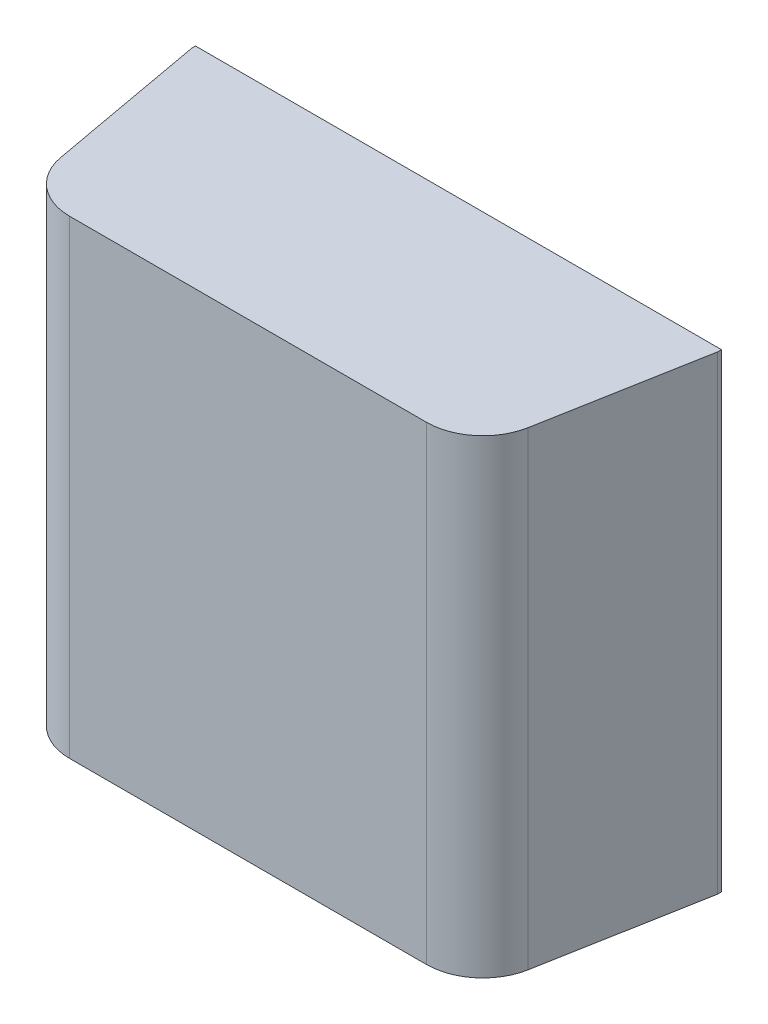
ISO-10303-21;
HEADER;
FILE_DESCRIPTION(('STEP AP214'),'2;1');
FILE_NAME('part.step','',(''),(''),'','','');
FILE_SCHEMA(('AUTOMOTIVE_DESIGN { 1 0 10303 214 1 1 1 1 }'));
ENDSEC;
DATA;
#1=APPLICATION_CONTEXT('core data for automotive mechanical design processes');
#2=APPLICATION_PROTOCOL_DEFINITION('international standard','automotive_design',2000,#1);
#3=PRODUCT_CONTEXT('',#1,'mechanical');
#4=PRODUCT('Part','Part','',(#3));
#5=PRODUCT_RELATED_PRODUCT_CATEGORY('part','',(#4));
#6=PRODUCT_DEFINITION_FORMATION('','',#4);
#7=PRODUCT_DEFINITION_CONTEXT('part definition',#1,'design');
#8=PRODUCT_DEFINITION('design','',#6,#7);
#9=PRODUCT_DEFINITION_SHAPE('','',#8);
#10=(LENGTH_UNIT() NAMED_UNIT(*) SI_UNIT(.MILLI.,.METRE.));
#11=(NAMED_UNIT(*) PLANE_ANGLE_UNIT() SI_UNIT($,.RADIAN.));
#12=(NAMED_UNIT(*) SI_UNIT($,.STERADIAN.) SOLID_ANGLE_UNIT());
#13=UNCERTAINTY_MEASURE_WITH_UNIT(LENGTH_MEASURE(1.E-05),#10,'distance_accuracy_value','');
#14=(GEOMETRIC_REPRESENTATION_CONTEXT(3) GLOBAL_UNCERTAINTY_ASSIGNED_CONTEXT((#13)) GLOBAL_UNIT_ASSIGNED_CONTEXT((#10,
#11,#12)) REPRESENTATION_CONTEXT('',''));
#15=CARTESIAN_POINT('',(0.,0.,0.));
#16=DIRECTION('',(0.,0.,1.));
#17=DIRECTION('',(1.,0.,0.));
#18=AXIS2_PLACEMENT_3D('',#15,#16,#17);
#19=CARTESIAN_POINT('',(-0.474813546988651,-0.625,0.8));
#20=DIRECTION('',(0.,0.,1.));
#21=DIRECTION('',(1.,0.,0.));
#22=AXIS2_PLACEMENT_3D('',#19,#20,#21);
#23=PLANE('',#22);
#24=DIRECTION('',(1.,0.,0.));
#25=VECTOR('',#24,1.);
#26=CARTESIAN_POINT('',(-0.474813546988651,-0.625,0.8));
#27=LINE('',#26,#25);
#28=CARTESIAN_POINT('',(-0.474813546988651,-0.625,0.8));
#29=VERTEX_POINT('',#28);
#30=CARTESIAN_POINT('',(0.474813546988651,-0.625,0.8));
#31=VERTEX_POINT('',#30);
#32=EDGE_CURVE('E122',#29,#31,#27,.T.);
#33=ORIENTED_EDGE('',*,*,#32,.T.);
#34=DIRECTION('',(0.,-1.,0.));
#35=VECTOR('',#34,1.);
#36=CARTESIAN_POINT('',(0.474813546988651,-0.625,0.8));
#37=LINE('',#36,#35);
#38=CARTESIAN_POINT('',(0.474813546988651,0.625,0.8));
#39=VERTEX_POINT('',#38);
#40=EDGE_CURVE('E93',#39,#31,#37,.T.);
#41=ORIENTED_EDGE('',*,*,#40,.F.);
#42=DIRECTION('',(1.,0.,0.));
#43=VECTOR('',#42,1.);
#44=CARTESIAN_POINT('',(-0.474813546988651,0.625,0.8));
#45=LINE('',#44,#43);
#46=CARTESIAN_POINT('',(-0.474813546988651,0.625,0.8));
#47=VERTEX_POINT('',#46);
#48=EDGE_CURVE('E91',#47,#39,#45,.T.);
#49=ORIENTED_EDGE('',*,*,#48,.F.);
#50=DIRECTION('',(0.,-1.,0.));
#51=VECTOR('',#50,1.);
#52=CARTESIAN_POINT('',(-0.474813546988651,-0.625,0.8));
#53=LINE('',#52,#51);
#54=EDGE_CURVE('E80',#29,#47,#53,.F.);
#55=ORIENTED_EDGE('',*,*,#54,.F.);
#56=EDGE_LOOP('',(#33,#41,#49,#55));
#57=FACE_BOUND('',#56,.T.);
#58=ADVANCED_FACE('F16',(#57),#23,.T.);
#59=CARTESIAN_POINT('',(0.474813546988651,-0.625,0.65));
#60=DIRECTION('',(0.,-1.,0.));
#61=DIRECTION('',(0.,0.,-1.));
#62=AXIS2_PLACEMENT_3D('',#59,#60,#61);
#63=CYLINDRICAL_SURFACE('',#62,0.15);
#64=CARTESIAN_POINT('',(0.474813546988651,-0.625,0.65));
#65=DIRECTION('',(0.,-1.,0.));
#66=DIRECTION('',(0.,0.,-1.));
#67=AXIS2_PLACEMENT_3D('',#64,#65,#66);
#68=CIRCLE('',#67,0.15);
#69=CARTESIAN_POINT('',(0.622394033503637,-0.625,0.676832815729997));
#70=VERTEX_POINT('',#69);
#71=EDGE_CURVE('E151',#31,#70,#68,.F.);
#72=ORIENTED_EDGE('',*,*,#71,.T.);
#73=DIRECTION('',(0.,1.,0.));
#74=VECTOR('',#73,1.);
#75=CARTESIAN_POINT('',(0.622394033503637,-0.625,0.676832815729997));
#76=LINE('',#75,#74);
#77=CARTESIAN_POINT('',(0.622394033503637,0.625,0.676832815729997));
#78=VERTEX_POINT('',#77);
#79=EDGE_CURVE('E88',#78,#70,#76,.F.);
#80=ORIENTED_EDGE('',*,*,#79,.F.);
#81=CARTESIAN_POINT('',(0.474813546988651,0.625,0.65));
#82=DIRECTION('',(0.,-1.,0.));
#83=DIRECTION('',(0.,0.,-1.));
#84=AXIS2_PLACEMENT_3D('',#81,#82,#83);
#85=CIRCLE('',#84,0.15);
#86=EDGE_CURVE('E97',#39,#78,#85,.F.);
#87=ORIENTED_EDGE('',*,*,#86,.F.);
#88=ORIENTED_EDGE('',*,*,#40,.T.);
#89=EDGE_LOOP('',(#72,#80,#87,#88));
#90=FACE_BOUND('',#89,.T.);
#91=ADVANCED_FACE('F182',(#90),#63,.T.);
#92=CARTESIAN_POINT('',(0.622394033503637,-0.625,0.676832815729997));
#93=DIRECTION('',(0.983869910099908,0.,0.178885438199981));
#94=DIRECTION('',(0.178885438199981,0.,-0.983869910099908));
#95=AXIS2_PLACEMENT_3D('',#92,#93,#94);
#96=PLANE('',#95);
#97=DIRECTION('',(0.178885438199983,0.,-0.983869910099907));
#98=VECTOR('',#97,1.);
#99=CARTESIAN_POINT('',(0.622394033503637,-0.625,0.676832815729997));
#100=LINE('',#99,#98);
#101=CARTESIAN_POINT('',(0.7,-0.625,0.249999999999999));
#102=VERTEX_POINT('',#101);
#103=EDGE_CURVE('E129',#70,#102,#100,.T.);
#104=ORIENTED_EDGE('',*,*,#103,.T.);
#105=DIRECTION('',(0.,1.,0.));
#106=VECTOR('',#105,1.);
#107=CARTESIAN_POINT('',(0.699999999999999,-0.625,0.25));
#108=LINE('',#107,#106);
#109=CARTESIAN_POINT('',(0.699999999999999,0.625000000000001,0.25));
#110=VERTEX_POINT('',#109);
#111=EDGE_CURVE('E119',#110,#102,#108,.F.);
#112=ORIENTED_EDGE('',*,*,#111,.F.);
#113=DIRECTION('',(0.178885438199983,0.,-0.983869910099907));
#114=VECTOR('',#113,1.);
#115=CARTESIAN_POINT('',(0.622394033503637,0.625,0.676832815729997));
#116=LINE('',#115,#114);
#117=EDGE_CURVE('E152',#78,#110,#116,.T.);
#118=ORIENTED_EDGE('',*,*,#117,.F.);
#119=ORIENTED_EDGE('',*,*,#79,.T.);
#120=EDGE_LOOP('',(#104,#112,#118,#119));
#121=FACE_BOUND('',#120,.T.);
#122=ADVANCED_FACE('F180',(#121),#96,.T.);
#123=CARTESIAN_POINT('',(-0.474813546988651,-0.625,0.65));
#124=DIRECTION('',(0.,-1.,0.));
#125=DIRECTION('',(0.,0.,-1.));
#126=AXIS2_PLACEMENT_3D('',#123,#124,#125);
#127=CYLINDRICAL_SURFACE('',#126,0.15);
#128=CARTESIAN_POINT('',(-0.474813546988651,-0.625,0.65));
#129=DIRECTION('',(0.,-1.,0.));
#130=DIRECTION('',(0.,0.,-1.));
#131=AXIS2_PLACEMENT_3D('',#128,#129,#130);
#132=CIRCLE('',#131,0.15);
#133=CARTESIAN_POINT('',(-0.622394033503637,-0.625,0.676832815729997));
#134=VERTEX_POINT('',#133);
#135=EDGE_CURVE('E84',#134,#29,#132,.F.);
#136=ORIENTED_EDGE('',*,*,#135,.T.);
#137=ORIENTED_EDGE('',*,*,#54,.T.);
#138=CARTESIAN_POINT('',(-0.474813546988651,0.625,0.65));
#139=DIRECTION('',(0.,-1.,0.));
#140=DIRECTION('',(0.,0.,-1.));
#141=AXIS2_PLACEMENT_3D('',#138,#139,#140);
#142=CIRCLE('',#141,0.15);
#143=CARTESIAN_POINT('',(-0.622394033503637,0.625,0.676832815729997));
#144=VERTEX_POINT('',#143);
#145=EDGE_CURVE('E19',#144,#47,#142,.F.);
#146=ORIENTED_EDGE('',*,*,#145,.F.);
#147=DIRECTION('',(0.,1.,0.));
#148=VECTOR('',#147,1.);
#149=CARTESIAN_POINT('',(-0.622394033503638,-0.625,0.676832815729997));
#150=LINE('',#149,#148);
#151=EDGE_CURVE('E87',#134,#144,#150,.T.);
#152=ORIENTED_EDGE('',*,*,#151,.F.);
#153=EDGE_LOOP('',(#136,#137,#146,#152));
#154=FACE_BOUND('',#153,.T.);
#155=ADVANCED_FACE('F82',(#154),#127,.T.);
#156=CARTESIAN_POINT('',(-0.7,-0.625,0.25));
#157=DIRECTION('',(-0.983869910099908,0.,0.178885438199981));
#158=DIRECTION('',(0.178885438199981,0.,0.983869910099908));
#159=AXIS2_PLACEMENT_3D('',#156,#157,#158);
#160=PLANE('',#159);
#161=DIRECTION('',(0.178885438199983,0.,0.983869910099907));
#162=VECTOR('',#161,1.);
#163=CARTESIAN_POINT('',(-0.7,-0.625,0.25));
#164=LINE('',#163,#162);
#165=CARTESIAN_POINT('',(-0.7,-0.625,0.249999999999998));
#166=VERTEX_POINT('',#165);
#167=EDGE_CURVE('E128',#166,#134,#164,.T.);
#168=ORIENTED_EDGE('',*,*,#167,.T.);
#169=ORIENTED_EDGE('',*,*,#151,.T.);
#170=DIRECTION('',(0.178885438199983,0.,0.983869910099907));
#171=VECTOR('',#170,1.);
#172=CARTESIAN_POINT('',(-0.7,0.625,0.25));
#173=LINE('',#172,#171);
#174=CARTESIAN_POINT('',(-0.7,0.625,0.249999999999999));
#175=VERTEX_POINT('',#174);
#176=EDGE_CURVE('E102',#175,#144,#173,.T.);
#177=ORIENTED_EDGE('',*,*,#176,.F.);
#178=DIRECTION('',(0.,1.,0.));
#179=VECTOR('',#178,1.);
#180=CARTESIAN_POINT('',(-0.7,-0.625,0.25));
#181=LINE('',#180,#179);
#182=EDGE_CURVE('E107',#166,#175,#181,.T.);
#183=ORIENTED_EDGE('',*,*,#182,.F.);
#184=EDGE_LOOP('',(#168,#169,#177,#183));
#185=FACE_BOUND('',#184,.T.);
#186=ADVANCED_FACE('F184',(#185),#160,.T.);
#187=CARTESIAN_POINT('',(-0.474813546988651,0.625,0.65));
#188=DIRECTION('',(0.,1.,0.));
#189=DIRECTION('',(0.,0.,1.));
#190=AXIS2_PLACEMENT_3D('',#187,#188,#189);
#191=PLANE('',#190);
#192=DIRECTION('',(0.,0.,1.));
#193=VECTOR('',#192,1.);
#194=CARTESIAN_POINT('',(-0.7,0.625,0.25));
#195=LINE('',#194,#193);
#196=CARTESIAN_POINT('',(-0.7,0.625,0.24));
#197=VERTEX_POINT('',#196);
#198=EDGE_CURVE('E114',#175,#197,#195,.F.);
#199=ORIENTED_EDGE('',*,*,#198,.F.);
#200=ORIENTED_EDGE('',*,*,#176,.T.);
#201=ORIENTED_EDGE('',*,*,#145,.T.);
#202=ORIENTED_EDGE('',*,*,#48,.T.);
#203=ORIENTED_EDGE('',*,*,#86,.T.);
#204=ORIENTED_EDGE('',*,*,#117,.T.);
#205=DIRECTION('',(0.0228950525334376,0.,-0.999737873929707));
#206=VECTOR('',#205,1.);
#207=CARTESIAN_POINT('',(0.70022901055497,0.625,0.24));
#208=LINE('',#207,#206);
#209=CARTESIAN_POINT('',(0.70022901055497,0.625,0.24));
#210=VERTEX_POINT('',#209);
#211=EDGE_CURVE('E123',#210,#110,#208,.F.);
#212=ORIENTED_EDGE('',*,*,#211,.F.);
#213=DIRECTION('',(-1.,0.,0.));
#214=VECTOR('',#213,1.);
#215=CARTESIAN_POINT('',(-0.7,0.625,0.24));
#216=LINE('',#215,#214);
#217=EDGE_CURVE('E110',#197,#210,#216,.F.);
#218=ORIENTED_EDGE('',*,*,#217,.F.);
#219=EDGE_LOOP('',(#199,#200,#201,#202,#203,#204,#212,#218));
#220=FACE_BOUND('',#219,.T.);
#221=ADVANCED_FACE('F101',(#220),#191,.T.);
#222=CARTESIAN_POINT('',(0.70022901055497,-0.625,0.24));
#223=DIRECTION('',(0.999737873929707,0.,0.0228950525334376));
#224=DIRECTION('',(0.0228950525334376,0.,-0.999737873929707));
#225=AXIS2_PLACEMENT_3D('',#222,#223,#224);
#226=PLANE('',#225);
#227=DIRECTION('',(0.0228950525333074,0.,-0.99973787392971));
#228=VECTOR('',#227,1.);
#229=CARTESIAN_POINT('',(0.7,-0.625,0.25));
#230=LINE('',#229,#228);
#231=CARTESIAN_POINT('',(0.70022901055497,-0.625,0.24));
#232=VERTEX_POINT('',#231);
#233=EDGE_CURVE('E126',#102,#232,#230,.T.);
#234=ORIENTED_EDGE('',*,*,#233,.T.);
#235=DIRECTION('',(0.,1.,0.));
#236=VECTOR('',#235,1.);
#237=CARTESIAN_POINT('',(0.70022901055497,-0.625,0.24));
#238=LINE('',#237,#236);
#239=EDGE_CURVE('E137',#210,#232,#238,.F.);
#240=ORIENTED_EDGE('',*,*,#239,.F.);
#241=ORIENTED_EDGE('',*,*,#211,.T.);
#242=ORIENTED_EDGE('',*,*,#111,.T.);
#243=EDGE_LOOP('',(#234,#240,#241,#242));
#244=FACE_BOUND('',#243,.T.);
#245=ADVANCED_FACE('F178',(#244),#226,.T.);
#246=CARTESIAN_POINT('',(-0.474813546988651,-0.625,0.65));
#247=DIRECTION('',(0.,1.,0.));
#248=DIRECTION('',(0.,0.,1.));
#249=AXIS2_PLACEMENT_3D('',#246,#247,#248);
#250=PLANE('',#249);
#251=ORIENTED_EDGE('',*,*,#167,.F.);
#252=DIRECTION('',(0.,0.,1.));
#253=VECTOR('',#252,1.);
#254=CARTESIAN_POINT('',(-0.7,-0.625,0.25));
#255=LINE('',#254,#253);
#256=CARTESIAN_POINT('',(-0.7,-0.625,0.24));
#257=VERTEX_POINT('',#256);
#258=EDGE_CURVE('E34',#257,#166,#255,.T.);
#259=ORIENTED_EDGE('',*,*,#258,.F.);
#260=DIRECTION('',(-1.,0.,0.));
#261=VECTOR('',#260,1.);
#262=CARTESIAN_POINT('',(-0.7,-0.625,0.24));
#263=LINE('',#262,#261);
#264=EDGE_CURVE('E25',#232,#257,#263,.T.);
#265=ORIENTED_EDGE('',*,*,#264,.F.);
#266=ORIENTED_EDGE('',*,*,#233,.F.);
#267=ORIENTED_EDGE('',*,*,#103,.F.);
#268=ORIENTED_EDGE('',*,*,#71,.F.);
#269=ORIENTED_EDGE('',*,*,#32,.F.);
#270=ORIENTED_EDGE('',*,*,#135,.F.);
#271=EDGE_LOOP('',(#251,#259,#265,#266,#267,#268,#269,#270));
#272=FACE_BOUND('',#271,.T.);
#273=ADVANCED_FACE('F174',(#272),#250,.F.);
#274=CARTESIAN_POINT('',(-0.7,-0.625,0.25));
#275=DIRECTION('',(-1.,0.,0.));
#276=DIRECTION('',(0.,0.,1.));
#277=AXIS2_PLACEMENT_3D('',#274,#275,#276);
#278=PLANE('',#277);
#279=ORIENTED_EDGE('',*,*,#258,.T.);
#280=ORIENTED_EDGE('',*,*,#182,.T.);
#281=ORIENTED_EDGE('',*,*,#198,.T.);
#282=DIRECTION('',(0.,1.,0.));
#283=VECTOR('',#282,1.);
#284=CARTESIAN_POINT('',(-0.7,-0.625,0.24));
#285=LINE('',#284,#283);
#286=EDGE_CURVE('E10',#257,#197,#285,.T.);
#287=ORIENTED_EDGE('',*,*,#286,.F.);
#288=EDGE_LOOP('',(#279,#280,#281,#287));
#289=FACE_BOUND('',#288,.T.);
#290=ADVANCED_FACE('F186',(#289),#278,.T.);
#291=CARTESIAN_POINT('',(-0.7,-0.625,0.24));
#292=DIRECTION('',(0.,0.,-1.));
#293=DIRECTION('',(-1.,0.,0.));
#294=AXIS2_PLACEMENT_3D('',#291,#292,#293);
#295=PLANE('',#294);
#296=ORIENTED_EDGE('',*,*,#264,.T.);
#297=ORIENTED_EDGE('',*,*,#286,.T.);
#298=ORIENTED_EDGE('',*,*,#217,.T.);
#299=ORIENTED_EDGE('',*,*,#239,.T.);
#300=EDGE_LOOP('',(#296,#297,#298,#299));
#301=FACE_BOUND('',#300,.T.);
#302=ADVANCED_FACE('F171',(#301),#295,.T.);
#303=CLOSED_SHELL('',(#58,#91,#122,#155,#186,#221,#245,#273,#290,#302));
#304=MANIFOLD_SOLID_BREP('B1',#303);
#305=ADVANCED_BREP_SHAPE_REPRESENTATION('',(#18,#304),#14);
#306=SHAPE_DEFINITION_REPRESENTATION(#9,#305);
ENDSEC;
END-ISO-10303-21;
